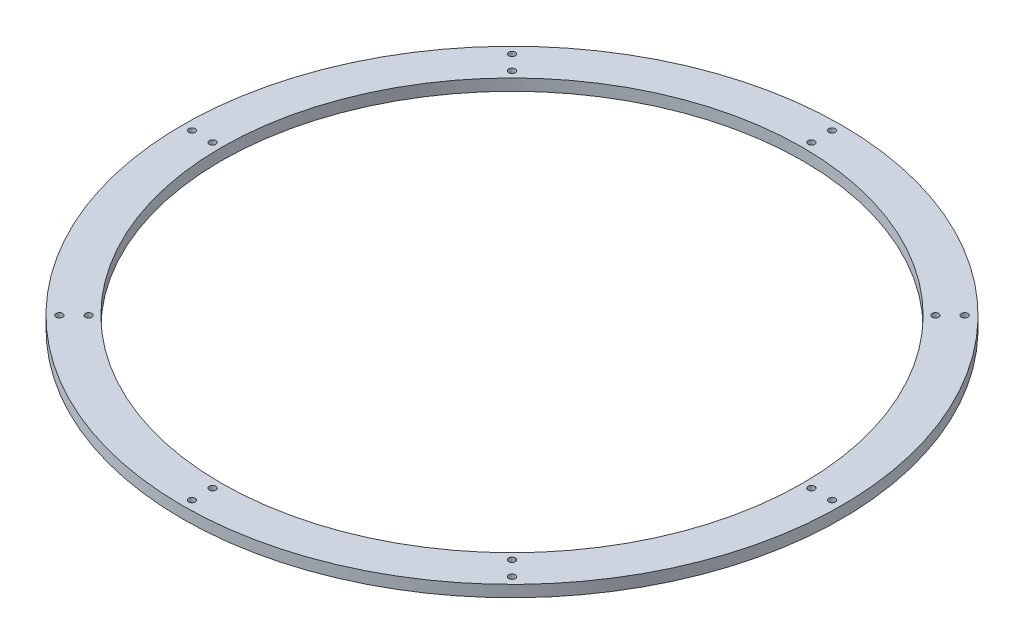
ISO-10303-21;
HEADER;
FILE_DESCRIPTION(('STEP AP214'),'2;1');
FILE_NAME('part.step','',(''),(''),'','','');
FILE_SCHEMA(('AUTOMOTIVE_DESIGN { 1 0 10303 214 1 1 1 1 }'));
ENDSEC;
DATA;
#1=APPLICATION_CONTEXT('core data for automotive mechanical design processes');
#2=APPLICATION_PROTOCOL_DEFINITION('international standard','automotive_design',2000,#1);
#3=PRODUCT_CONTEXT('',#1,'mechanical');
#4=PRODUCT('Part','Part','',(#3));
#5=PRODUCT_RELATED_PRODUCT_CATEGORY('part','',(#4));
#6=PRODUCT_DEFINITION_FORMATION('','',#4);
#7=PRODUCT_DEFINITION_CONTEXT('part definition',#1,'design');
#8=PRODUCT_DEFINITION('design','',#6,#7);
#9=PRODUCT_DEFINITION_SHAPE('','',#8);
#10=(LENGTH_UNIT() NAMED_UNIT(*) SI_UNIT(.MILLI.,.METRE.));
#11=(NAMED_UNIT(*) PLANE_ANGLE_UNIT() SI_UNIT($,.RADIAN.));
#12=(NAMED_UNIT(*) SI_UNIT($,.STERADIAN.) SOLID_ANGLE_UNIT());
#13=UNCERTAINTY_MEASURE_WITH_UNIT(LENGTH_MEASURE(1.E-05),#10,'distance_accuracy_value','');
#14=(GEOMETRIC_REPRESENTATION_CONTEXT(3) GLOBAL_UNCERTAINTY_ASSIGNED_CONTEXT((#13)) GLOBAL_UNIT_ASSIGNED_CONTEXT((#10,
#11,#12)) REPRESENTATION_CONTEXT('',''));
#15=CARTESIAN_POINT('',(0.,0.,0.));
#16=DIRECTION('',(0.,0.,1.));
#17=DIRECTION('',(1.,0.,0.));
#18=AXIS2_PLACEMENT_3D('',#15,#16,#17);
#19=CARTESIAN_POINT('',(0.,14.,0.));
#20=DIRECTION('',(0.,-1.,0.));
#21=DIRECTION('',(0.,0.,-1.));
#22=AXIS2_PLACEMENT_3D('',#19,#20,#21);
#23=CYLINDRICAL_SURFACE('',#22,399.);
#24=CARTESIAN_POINT('',(0.,14.,0.));
#25=DIRECTION('',(0.,1.,0.));
#26=DIRECTION('',(0.,0.,1.));
#27=AXIS2_PLACEMENT_3D('',#24,#25,#26);
#28=CIRCLE('',#27,399.);
#29=CARTESIAN_POINT('',(0.,14.,399.));
#30=VERTEX_POINT('',#29);
#31=EDGE_CURVE('E12',#30,#30,#28,.T.);
#32=ORIENTED_EDGE('',*,*,#31,.F.);
#33=EDGE_LOOP('',(#32));
#34=FACE_BOUND('',#33,.T.);
#35=CARTESIAN_POINT('',(0.,0.,0.));
#36=DIRECTION('',(0.,1.,0.));
#37=DIRECTION('',(0.,0.,1.));
#38=AXIS2_PLACEMENT_3D('',#35,#36,#37);
#39=CIRCLE('',#38,399.);
#40=CARTESIAN_POINT('',(0.,0.,399.));
#41=VERTEX_POINT('',#40);
#42=EDGE_CURVE('E49',#41,#41,#39,.T.);
#43=ORIENTED_EDGE('',*,*,#42,.T.);
#44=EDGE_LOOP('',(#43));
#45=FACE_BOUND('',#44,.T.);
#46=ADVANCED_FACE('F46',(#34,#45),#23,.T.);
#47=CARTESIAN_POINT('',(0.,14.,0.));
#48=DIRECTION('',(0.,1.,0.));
#49=DIRECTION('',(0.,0.,1.));
#50=AXIS2_PLACEMENT_3D('',#47,#48,#49);
#51=PLANE('',#50);
#52=CARTESIAN_POINT('',(-362.5,14.,1.26566198533064E-12));
#53=DIRECTION('',(0.,1.,0.));
#54=DIRECTION('',(1.,0.,0.));
#55=AXIS2_PLACEMENT_3D('',#52,#53,#54);
#56=CIRCLE('',#55,4.);
#57=CARTESIAN_POINT('',(-358.5,14.,1.25169605997526E-12));
#58=VERTEX_POINT('',#57);
#59=EDGE_CURVE('E143',#58,#58,#56,.T.);
#60=ORIENTED_EDGE('',*,*,#59,.F.);
#61=EDGE_LOOP('',(#60));
#62=FACE_BOUND('',#61,.T.);
#63=CARTESIAN_POINT('',(-256.326208180122,14.,256.326208180125));
#64=DIRECTION('',(0.,1.,0.));
#65=DIRECTION('',(0.707106781186544,0.,-0.707106781186551));
#66=AXIS2_PLACEMENT_3D('',#63,#64,#65);
#67=CIRCLE('',#66,4.);
#68=CARTESIAN_POINT('',(-253.497781055376,14.,253.497781055379));
#69=VERTEX_POINT('',#68);
#70=EDGE_CURVE('E137',#69,#69,#67,.T.);
#71=ORIENTED_EDGE('',*,*,#70,.F.);
#72=EDGE_LOOP('',(#71));
#73=FACE_BOUND('',#72,.T.);
#74=CARTESIAN_POINT('',(0.,14.,362.5));
#75=DIRECTION('',(0.,1.,0.));
#76=DIRECTION('',(0.,0.,-1.));
#77=AXIS2_PLACEMENT_3D('',#74,#75,#76);
#78=CIRCLE('',#77,4.);
#79=CARTESIAN_POINT('',(0.,14.,358.5));
#80=VERTEX_POINT('',#79);
#81=EDGE_CURVE('E131',#80,#80,#78,.T.);
#82=ORIENTED_EDGE('',*,*,#81,.F.);
#83=EDGE_LOOP('',(#82));
#84=FACE_BOUND('',#83,.T.);
#85=CARTESIAN_POINT('',(256.326208180126,14.,256.326208180121));
#86=DIRECTION('',(0.,1.,0.));
#87=DIRECTION('',(-0.707106781186554,0.,-0.707106781186541));
#88=AXIS2_PLACEMENT_3D('',#85,#86,#87);
#89=CIRCLE('',#88,4.);
#90=CARTESIAN_POINT('',(253.497781055379,14.,253.497781055375));
#91=VERTEX_POINT('',#90);
#92=EDGE_CURVE('E124',#91,#91,#89,.T.);
#93=ORIENTED_EDGE('',*,*,#92,.F.);
#94=EDGE_LOOP('',(#93));
#95=FACE_BOUND('',#94,.T.);
#96=CARTESIAN_POINT('',(362.5,14.,-3.79698595599191E-12));
#97=DIRECTION('',(0.,1.,0.));
#98=DIRECTION('',(-1.,0.,0.));
#99=AXIS2_PLACEMENT_3D('',#96,#97,#98);
#100=CIRCLE('',#99,4.);
#101=CARTESIAN_POINT('',(358.5,14.,-3.75508817992579E-12));
#102=VERTEX_POINT('',#101);
#103=EDGE_CURVE('E154',#102,#102,#100,.T.);
#104=ORIENTED_EDGE('',*,*,#103,.F.);
#105=EDGE_LOOP('',(#104));
#106=FACE_BOUND('',#105,.T.);
#107=CARTESIAN_POINT('',(256.32620818012,14.,-256.326208180127));
#108=DIRECTION('',(0.,1.,0.));
#109=DIRECTION('',(-0.707106781186539,0.,0.707106781186556));
#110=AXIS2_PLACEMENT_3D('',#107,#108,#109);
#111=CIRCLE('',#110,4.);
#112=CARTESIAN_POINT('',(253.497781055374,14.,-253.49778105538));
#113=VERTEX_POINT('',#112);
#114=EDGE_CURVE('E148',#113,#113,#111,.T.);
#115=ORIENTED_EDGE('',*,*,#114,.F.);
#116=EDGE_LOOP('',(#115));
#117=FACE_BOUND('',#116,.T.);
#118=CARTESIAN_POINT('',(-256.326208180124,14.,-256.326208180123));
#119=DIRECTION('',(0.,1.,0.));
#120=DIRECTION('',(0.707106781186549,0.,0.707106781186546));
#121=AXIS2_PLACEMENT_3D('',#118,#119,#120);
#122=CIRCLE('',#121,4.);
#123=CARTESIAN_POINT('',(-253.497781055378,14.,-253.497781055377));
#124=VERTEX_POINT('',#123);
#125=EDGE_CURVE('E118',#124,#124,#122,.T.);
#126=ORIENTED_EDGE('',*,*,#125,.F.);
#127=EDGE_LOOP('',(#126));
#128=FACE_BOUND('',#127,.T.);
#129=CARTESIAN_POINT('',(0.,14.,-362.5));
#130=DIRECTION('',(0.,1.,0.));
#131=DIRECTION('',(0.,0.,1.));
#132=AXIS2_PLACEMENT_3D('',#129,#130,#131);
#133=CIRCLE('',#132,4.);
#134=CARTESIAN_POINT('',(0.,14.,-358.5));
#135=VERTEX_POINT('',#134);
#136=EDGE_CURVE('E112',#135,#135,#133,.T.);
#137=ORIENTED_EDGE('',*,*,#136,.F.);
#138=EDGE_LOOP('',(#137));
#139=FACE_BOUND('',#138,.T.);
#140=CARTESIAN_POINT('',(387.499999999999,14.,1.35294901880171E-12));
#141=DIRECTION('',(0.,1.,0.));
#142=DIRECTION('',(0.,0.,1.));
#143=AXIS2_PLACEMENT_3D('',#140,#141,#142);
#144=CIRCLE('',#143,4.);
#145=CARTESIAN_POINT('',(387.499999999999,14.,4.00000000000135));
#146=VERTEX_POINT('',#145);
#147=EDGE_CURVE('E69',#146,#146,#144,.T.);
#148=ORIENTED_EDGE('',*,*,#147,.F.);
#149=EDGE_LOOP('',(#148));
#150=FACE_BOUND('',#149,.T.);
#151=CARTESIAN_POINT('',(274.003877709785,14.,274.003877709788));
#152=DIRECTION('',(0.,1.,0.));
#153=DIRECTION('',(0.,0.,1.));
#154=AXIS2_PLACEMENT_3D('',#151,#152,#153);
#155=CIRCLE('',#154,4.);
#156=CARTESIAN_POINT('',(274.003877709785,14.,278.003877709788));
#157=VERTEX_POINT('',#156);
#158=EDGE_CURVE('E72',#157,#157,#155,.T.);
#159=ORIENTED_EDGE('',*,*,#158,.F.);
#160=EDGE_LOOP('',(#159));
#161=FACE_BOUND('',#160,.T.);
#162=CARTESIAN_POINT('',(0.,14.,387.499999999999));
#163=DIRECTION('',(0.,1.,0.));
#164=DIRECTION('',(0.,0.,1.));
#165=AXIS2_PLACEMENT_3D('',#162,#163,#164);
#166=CIRCLE('',#165,4.);
#167=CARTESIAN_POINT('',(0.,14.,391.499999999999));
#168=VERTEX_POINT('',#167);
#169=EDGE_CURVE('E75',#168,#168,#166,.T.);
#170=ORIENTED_EDGE('',*,*,#169,.F.);
#171=EDGE_LOOP('',(#170));
#172=FACE_BOUND('',#171,.T.);
#173=CARTESIAN_POINT('',(-274.003877709789,14.,274.003877709784));
#174=DIRECTION('',(0.,1.,0.));
#175=DIRECTION('',(0.,0.,1.));
#176=AXIS2_PLACEMENT_3D('',#173,#174,#175);
#177=CIRCLE('',#176,4.);
#178=CARTESIAN_POINT('',(-274.003877709789,14.,278.003877709784));
#179=VERTEX_POINT('',#178);
#180=EDGE_CURVE('E78',#179,#179,#177,.T.);
#181=ORIENTED_EDGE('',*,*,#180,.F.);
#182=EDGE_LOOP('',(#181));
#183=FACE_BOUND('',#182,.T.);
#184=CARTESIAN_POINT('',(-387.499999999999,14.,-4.05884705640514E-12));
#185=DIRECTION('',(0.,1.,0.));
#186=DIRECTION('',(0.,0.,1.));
#187=AXIS2_PLACEMENT_3D('',#184,#185,#186);
#188=CIRCLE('',#187,4.);
#189=CARTESIAN_POINT('',(-387.499999999999,14.,3.99999999999594));
#190=VERTEX_POINT('',#189);
#191=EDGE_CURVE('E81',#190,#190,#188,.T.);
#192=ORIENTED_EDGE('',*,*,#191,.F.);
#193=EDGE_LOOP('',(#192));
#194=FACE_BOUND('',#193,.T.);
#195=CARTESIAN_POINT('',(-274.003877709783,14.,-274.00387770979));
#196=DIRECTION('',(0.,1.,0.));
#197=DIRECTION('',(0.,0.,1.));
#198=AXIS2_PLACEMENT_3D('',#195,#196,#197);
#199=CIRCLE('',#198,4.);
#200=CARTESIAN_POINT('',(-274.003877709783,14.,-270.00387770979));
#201=VERTEX_POINT('',#200);
#202=EDGE_CURVE('E84',#201,#201,#199,.T.);
#203=ORIENTED_EDGE('',*,*,#202,.F.);
#204=EDGE_LOOP('',(#203));
#205=FACE_BOUND('',#204,.T.);
#206=CARTESIAN_POINT('',(274.003877709787,14.,-274.003877709786));
#207=DIRECTION('',(0.,1.,0.));
#208=DIRECTION('',(0.,0.,1.));
#209=AXIS2_PLACEMENT_3D('',#206,#207,#208);
#210=CIRCLE('',#209,4.);
#211=CARTESIAN_POINT('',(274.003877709787,14.,-270.003877709786));
#212=VERTEX_POINT('',#211);
#213=EDGE_CURVE('E87',#212,#212,#210,.T.);
#214=ORIENTED_EDGE('',*,*,#213,.F.);
#215=EDGE_LOOP('',(#214));
#216=FACE_BOUND('',#215,.T.);
#217=CARTESIAN_POINT('',(0.,14.,-387.499999999999));
#218=DIRECTION('',(0.,1.,0.));
#219=DIRECTION('',(0.,0.,1.));
#220=AXIS2_PLACEMENT_3D('',#217,#218,#219);
#221=CIRCLE('',#220,4.);
#222=CARTESIAN_POINT('',(0.,14.,-383.499999999999));
#223=VERTEX_POINT('',#222);
#224=EDGE_CURVE('E61',#223,#223,#221,.T.);
#225=ORIENTED_EDGE('',*,*,#224,.F.);
#226=EDGE_LOOP('',(#225));
#227=FACE_BOUND('',#226,.T.);
#228=CARTESIAN_POINT('',(0.,14.,0.));
#229=DIRECTION('',(0.,1.,0.));
#230=DIRECTION('',(0.,0.,1.));
#231=AXIS2_PLACEMENT_3D('',#228,#229,#230);
#232=CIRCLE('',#231,352.);
#233=CARTESIAN_POINT('',(0.,14.,352.));
#234=VERTEX_POINT('',#233);
#235=EDGE_CURVE('E58',#234,#234,#232,.T.);
#236=ORIENTED_EDGE('',*,*,#235,.F.);
#237=EDGE_LOOP('',(#236));
#238=FACE_BOUND('',#237,.T.);
#239=ORIENTED_EDGE('',*,*,#31,.T.);
#240=EDGE_LOOP('',(#239));
#241=FACE_BOUND('',#240,.T.);
#242=ADVANCED_FACE('F171',(#62,#73,#84,#95,#106,#117,#128,#139,#150,#161,#172,#183,#194,#205,
#216,#227,#238,#241),#51,.T.);
#243=CARTESIAN_POINT('',(0.,0.,0.));
#244=DIRECTION('',(0.,1.,0.));
#245=DIRECTION('',(0.,0.,1.));
#246=AXIS2_PLACEMENT_3D('',#243,#244,#245);
#247=PLANE('',#246);
#248=CARTESIAN_POINT('',(-362.5,0.,1.26566198533064E-12));
#249=DIRECTION('',(0.,1.,0.));
#250=DIRECTION('',(1.,0.,0.));
#251=AXIS2_PLACEMENT_3D('',#248,#249,#250);
#252=CIRCLE('',#251,4.);
#253=CARTESIAN_POINT('',(-358.5,0.,1.25169605997526E-12));
#254=VERTEX_POINT('',#253);
#255=EDGE_CURVE('E121',#254,#254,#252,.T.);
#256=ORIENTED_EDGE('',*,*,#255,.T.);
#257=EDGE_LOOP('',(#256));
#258=FACE_BOUND('',#257,.T.);
#259=CARTESIAN_POINT('',(-256.326208180122,0.,256.326208180125));
#260=DIRECTION('',(0.,1.,0.));
#261=DIRECTION('',(0.707106781186544,0.,-0.707106781186551));
#262=AXIS2_PLACEMENT_3D('',#259,#260,#261);
#263=CIRCLE('',#262,4.);
#264=CARTESIAN_POINT('',(-253.497781055376,0.,253.497781055379));
#265=VERTEX_POINT('',#264);
#266=EDGE_CURVE('E140',#265,#265,#263,.T.);
#267=ORIENTED_EDGE('',*,*,#266,.T.);
#268=EDGE_LOOP('',(#267));
#269=FACE_BOUND('',#268,.T.);
#270=CARTESIAN_POINT('',(0.,0.,362.5));
#271=DIRECTION('',(0.,1.,0.));
#272=DIRECTION('',(0.,0.,-1.));
#273=AXIS2_PLACEMENT_3D('',#270,#271,#272);
#274=CIRCLE('',#273,4.);
#275=CARTESIAN_POINT('',(0.,0.,358.5));
#276=VERTEX_POINT('',#275);
#277=EDGE_CURVE('E134',#276,#276,#274,.T.);
#278=ORIENTED_EDGE('',*,*,#277,.T.);
#279=EDGE_LOOP('',(#278));
#280=FACE_BOUND('',#279,.T.);
#281=CARTESIAN_POINT('',(256.326208180126,0.,256.326208180121));
#282=DIRECTION('',(0.,1.,0.));
#283=DIRECTION('',(-0.707106781186554,0.,-0.707106781186541));
#284=AXIS2_PLACEMENT_3D('',#281,#282,#283);
#285=CIRCLE('',#284,4.);
#286=CARTESIAN_POINT('',(253.497781055379,0.,253.497781055375));
#287=VERTEX_POINT('',#286);
#288=EDGE_CURVE('E127',#287,#287,#285,.T.);
#289=ORIENTED_EDGE('',*,*,#288,.T.);
#290=EDGE_LOOP('',(#289));
#291=FACE_BOUND('',#290,.T.);
#292=CARTESIAN_POINT('',(362.5,0.,-3.79698595599191E-12));
#293=DIRECTION('',(0.,1.,0.));
#294=DIRECTION('',(-1.,0.,0.));
#295=AXIS2_PLACEMENT_3D('',#292,#293,#294);
#296=CIRCLE('',#295,4.);
#297=CARTESIAN_POINT('',(358.5,0.,-3.75508817992579E-12));
#298=VERTEX_POINT('',#297);
#299=EDGE_CURVE('E128',#298,#298,#296,.T.);
#300=ORIENTED_EDGE('',*,*,#299,.T.);
#301=EDGE_LOOP('',(#300));
#302=FACE_BOUND('',#301,.T.);
#303=CARTESIAN_POINT('',(256.32620818012,0.,-256.326208180127));
#304=DIRECTION('',(0.,1.,0.));
#305=DIRECTION('',(-0.707106781186539,0.,0.707106781186556));
#306=AXIS2_PLACEMENT_3D('',#303,#304,#305);
#307=CIRCLE('',#306,4.);
#308=CARTESIAN_POINT('',(253.497781055374,0.,-253.49778105538));
#309=VERTEX_POINT('',#308);
#310=EDGE_CURVE('E151',#309,#309,#307,.T.);
#311=ORIENTED_EDGE('',*,*,#310,.T.);
#312=EDGE_LOOP('',(#311));
#313=FACE_BOUND('',#312,.T.);
#314=CARTESIAN_POINT('',(-256.326208180124,0.,-256.326208180123));
#315=DIRECTION('',(0.,1.,0.));
#316=DIRECTION('',(0.707106781186549,0.,0.707106781186546));
#317=AXIS2_PLACEMENT_3D('',#314,#315,#316);
#318=CIRCLE('',#317,4.);
#319=CARTESIAN_POINT('',(-253.497781055378,0.,-253.497781055377));
#320=VERTEX_POINT('',#319);
#321=EDGE_CURVE('E115',#320,#320,#318,.T.);
#322=ORIENTED_EDGE('',*,*,#321,.T.);
#323=EDGE_LOOP('',(#322));
#324=FACE_BOUND('',#323,.T.);
#325=CARTESIAN_POINT('',(0.,0.,-362.5));
#326=DIRECTION('',(0.,1.,0.));
#327=DIRECTION('',(0.,0.,1.));
#328=AXIS2_PLACEMENT_3D('',#325,#326,#327);
#329=CIRCLE('',#328,4.);
#330=CARTESIAN_POINT('',(0.,0.,-358.5));
#331=VERTEX_POINT('',#330);
#332=EDGE_CURVE('E109',#331,#331,#329,.T.);
#333=ORIENTED_EDGE('',*,*,#332,.T.);
#334=EDGE_LOOP('',(#333));
#335=FACE_BOUND('',#334,.T.);
#336=CARTESIAN_POINT('',(387.499999999999,0.,1.35294901880171E-12));
#337=DIRECTION('',(0.,-1.,0.));
#338=DIRECTION('',(1.,0.,0.));
#339=AXIS2_PLACEMENT_3D('',#336,#337,#338);
#340=CIRCLE('',#339,4.);
#341=CARTESIAN_POINT('',(391.499999999999,0.,1.36691494415708E-12));
#342=VERTEX_POINT('',#341);
#343=EDGE_CURVE('E93',#342,#342,#340,.T.);
#344=ORIENTED_EDGE('',*,*,#343,.F.);
#345=EDGE_LOOP('',(#344));
#346=FACE_BOUND('',#345,.T.);
#347=CARTESIAN_POINT('',(274.003877709785,0.,274.003877709788));
#348=DIRECTION('',(0.,-1.,0.));
#349=DIRECTION('',(0.707106781186544,0.,0.707106781186551));
#350=AXIS2_PLACEMENT_3D('',#347,#348,#349);
#351=CIRCLE('',#350,4.);
#352=CARTESIAN_POINT('',(276.832304834531,0.,276.832304834534));
#353=VERTEX_POINT('',#352);
#354=EDGE_CURVE('E101',#353,#353,#351,.T.);
#355=ORIENTED_EDGE('',*,*,#354,.F.);
#356=EDGE_LOOP('',(#355));
#357=FACE_BOUND('',#356,.T.);
#358=CARTESIAN_POINT('',(0.,0.,387.499999999999));
#359=DIRECTION('',(0.,-1.,0.));
#360=DIRECTION('',(0.,0.,1.));
#361=AXIS2_PLACEMENT_3D('',#358,#359,#360);
#362=CIRCLE('',#361,4.);
#363=CARTESIAN_POINT('',(0.,0.,391.499999999999));
#364=VERTEX_POINT('',#363);
#365=EDGE_CURVE('E97',#364,#364,#362,.T.);
#366=ORIENTED_EDGE('',*,*,#365,.F.);
#367=EDGE_LOOP('',(#366));
#368=FACE_BOUND('',#367,.T.);
#369=CARTESIAN_POINT('',(-274.003877709789,0.,274.003877709784));
#370=DIRECTION('',(0.,-1.,0.));
#371=DIRECTION('',(-0.707106781186554,0.,0.707106781186541));
#372=AXIS2_PLACEMENT_3D('',#369,#370,#371);
#373=CIRCLE('',#372,4.);
#374=CARTESIAN_POINT('',(-276.832304834535,0.,276.83230483453));
#375=VERTEX_POINT('',#374);
#376=EDGE_CURVE('E94',#375,#375,#373,.T.);
#377=ORIENTED_EDGE('',*,*,#376,.F.);
#378=EDGE_LOOP('',(#377));
#379=FACE_BOUND('',#378,.T.);
#380=CARTESIAN_POINT('',(-387.499999999999,0.,-4.05884705640514E-12));
#381=DIRECTION('',(0.,-1.,0.));
#382=DIRECTION('',(-1.,0.,0.));
#383=AXIS2_PLACEMENT_3D('',#380,#381,#382);
#384=CIRCLE('',#383,4.);
#385=CARTESIAN_POINT('',(-391.499999999999,0.,-4.10074483247125E-12));
#386=VERTEX_POINT('',#385);
#387=EDGE_CURVE('E98',#386,#386,#384,.T.);
#388=ORIENTED_EDGE('',*,*,#387,.F.);
#389=EDGE_LOOP('',(#388));
#390=FACE_BOUND('',#389,.T.);
#391=CARTESIAN_POINT('',(-274.003877709783,0.,-274.00387770979));
#392=DIRECTION('',(0.,-1.,0.));
#393=DIRECTION('',(-0.707106781186539,0.,-0.707106781186556));
#394=AXIS2_PLACEMENT_3D('',#391,#392,#393);
#395=CIRCLE('',#394,4.);
#396=CARTESIAN_POINT('',(-276.83230483453,0.,-276.832304834536));
#397=VERTEX_POINT('',#396);
#398=EDGE_CURVE('E106',#397,#397,#395,.T.);
#399=ORIENTED_EDGE('',*,*,#398,.F.);
#400=EDGE_LOOP('',(#399));
#401=FACE_BOUND('',#400,.T.);
#402=CARTESIAN_POINT('',(274.003877709787,0.,-274.003877709786));
#403=DIRECTION('',(0.,-1.,0.));
#404=DIRECTION('',(0.707106781186549,0.,-0.707106781186546));
#405=AXIS2_PLACEMENT_3D('',#402,#403,#404);
#406=CIRCLE('',#405,4.);
#407=CARTESIAN_POINT('',(276.832304834533,0.,-276.832304834532));
#408=VERTEX_POINT('',#407);
#409=EDGE_CURVE('E90',#408,#408,#406,.T.);
#410=ORIENTED_EDGE('',*,*,#409,.F.);
#411=EDGE_LOOP('',(#410));
#412=FACE_BOUND('',#411,.T.);
#413=CARTESIAN_POINT('',(0.,0.,-387.499999999999));
#414=DIRECTION('',(0.,-1.,0.));
#415=DIRECTION('',(0.,0.,-1.));
#416=AXIS2_PLACEMENT_3D('',#413,#414,#415);
#417=CIRCLE('',#416,4.);
#418=CARTESIAN_POINT('',(0.,0.,-391.499999999999));
#419=VERTEX_POINT('',#418);
#420=EDGE_CURVE('E66',#419,#419,#417,.T.);
#421=ORIENTED_EDGE('',*,*,#420,.F.);
#422=EDGE_LOOP('',(#421));
#423=FACE_BOUND('',#422,.T.);
#424=CARTESIAN_POINT('',(0.,0.,0.));
#425=DIRECTION('',(0.,1.,0.));
#426=DIRECTION('',(0.,0.,1.));
#427=AXIS2_PLACEMENT_3D('',#424,#425,#426);
#428=CIRCLE('',#427,352.);
#429=CARTESIAN_POINT('',(0.,0.,352.));
#430=VERTEX_POINT('',#429);
#431=EDGE_CURVE('E56',#430,#430,#428,.T.);
#432=ORIENTED_EDGE('',*,*,#431,.T.);
#433=EDGE_LOOP('',(#432));
#434=FACE_BOUND('',#433,.T.);
#435=ORIENTED_EDGE('',*,*,#42,.F.);
#436=EDGE_LOOP('',(#435));
#437=FACE_BOUND('',#436,.T.);
#438=ADVANCED_FACE('F160',(#258,#269,#280,#291,#302,#313,#324,#335,#346,#357,#368,#379,#390,
#401,#412,#423,#434,#437),#247,.F.);
#439=CARTESIAN_POINT('',(0.,0.,0.));
#440=DIRECTION('',(0.,1.,0.));
#441=DIRECTION('',(0.,0.,1.));
#442=AXIS2_PLACEMENT_3D('',#439,#440,#441);
#443=CYLINDRICAL_SURFACE('',#442,352.);
#444=ORIENTED_EDGE('',*,*,#431,.F.);
#445=EDGE_LOOP('',(#444));
#446=FACE_BOUND('',#445,.T.);
#447=ORIENTED_EDGE('',*,*,#235,.T.);
#448=EDGE_LOOP('',(#447));
#449=FACE_BOUND('',#448,.T.);
#450=ADVANCED_FACE('F200',(#446,#449),#443,.F.);
#451=CARTESIAN_POINT('',(0.,19.304,-387.499999999999));
#452=DIRECTION('',(0.,-1.,0.));
#453=DIRECTION('',(0.,0.,-1.));
#454=AXIS2_PLACEMENT_3D('',#451,#452,#453);
#455=CYLINDRICAL_SURFACE('',#454,4.);
#456=ORIENTED_EDGE('',*,*,#224,.T.);
#457=EDGE_LOOP('',(#456));
#458=FACE_BOUND('',#457,.T.);
#459=ORIENTED_EDGE('',*,*,#420,.T.);
#460=EDGE_LOOP('',(#459));
#461=FACE_BOUND('',#460,.T.);
#462=ADVANCED_FACE('F202',(#458,#461),#455,.F.);
#463=CARTESIAN_POINT('',(274.003877709787,19.304,-274.003877709786));
#464=DIRECTION('',(0.,-1.,0.));
#465=DIRECTION('',(0.,0.,-1.));
#466=AXIS2_PLACEMENT_3D('',#463,#464,#465);
#467=CYLINDRICAL_SURFACE('',#466,4.);
#468=ORIENTED_EDGE('',*,*,#213,.T.);
#469=EDGE_LOOP('',(#468));
#470=FACE_BOUND('',#469,.T.);
#471=ORIENTED_EDGE('',*,*,#409,.T.);
#472=EDGE_LOOP('',(#471));
#473=FACE_BOUND('',#472,.T.);
#474=ADVANCED_FACE('F209',(#470,#473),#467,.F.);
#475=CARTESIAN_POINT('',(-274.003877709783,19.304,-274.00387770979));
#476=DIRECTION('',(0.,-1.,0.));
#477=DIRECTION('',(0.,0.,-1.));
#478=AXIS2_PLACEMENT_3D('',#475,#476,#477);
#479=CYLINDRICAL_SURFACE('',#478,4.);
#480=ORIENTED_EDGE('',*,*,#202,.T.);
#481=EDGE_LOOP('',(#480));
#482=FACE_BOUND('',#481,.T.);
#483=ORIENTED_EDGE('',*,*,#398,.T.);
#484=EDGE_LOOP('',(#483));
#485=FACE_BOUND('',#484,.T.);
#486=ADVANCED_FACE('F312',(#482,#485),#479,.F.);
#487=CARTESIAN_POINT('',(-387.499999999999,19.304,-4.05884705640514E-12));
#488=DIRECTION('',(0.,-1.,0.));
#489=DIRECTION('',(0.,0.,-1.));
#490=AXIS2_PLACEMENT_3D('',#487,#488,#489);
#491=CYLINDRICAL_SURFACE('',#490,4.);
#492=ORIENTED_EDGE('',*,*,#191,.T.);
#493=EDGE_LOOP('',(#492));
#494=FACE_BOUND('',#493,.T.);
#495=ORIENTED_EDGE('',*,*,#387,.T.);
#496=EDGE_LOOP('',(#495));
#497=FACE_BOUND('',#496,.T.);
#498=ADVANCED_FACE('F308',(#494,#497),#491,.F.);
#499=CARTESIAN_POINT('',(-274.003877709789,19.304,274.003877709784));
#500=DIRECTION('',(0.,-1.,0.));
#501=DIRECTION('',(0.,0.,-1.));
#502=AXIS2_PLACEMENT_3D('',#499,#500,#501);
#503=CYLINDRICAL_SURFACE('',#502,4.);
#504=ORIENTED_EDGE('',*,*,#180,.T.);
#505=EDGE_LOOP('',(#504));
#506=FACE_BOUND('',#505,.T.);
#507=ORIENTED_EDGE('',*,*,#376,.T.);
#508=EDGE_LOOP('',(#507));
#509=FACE_BOUND('',#508,.T.);
#510=ADVANCED_FACE('F311',(#506,#509),#503,.F.);
#511=CARTESIAN_POINT('',(0.,19.304,387.499999999999));
#512=DIRECTION('',(0.,-1.,0.));
#513=DIRECTION('',(0.,0.,-1.));
#514=AXIS2_PLACEMENT_3D('',#511,#512,#513);
#515=CYLINDRICAL_SURFACE('',#514,4.);
#516=ORIENTED_EDGE('',*,*,#169,.T.);
#517=EDGE_LOOP('',(#516));
#518=FACE_BOUND('',#517,.T.);
#519=ORIENTED_EDGE('',*,*,#365,.T.);
#520=EDGE_LOOP('',(#519));
#521=FACE_BOUND('',#520,.T.);
#522=ADVANCED_FACE('F323',(#518,#521),#515,.F.);
#523=CARTESIAN_POINT('',(274.003877709785,19.304,274.003877709788));
#524=DIRECTION('',(0.,-1.,0.));
#525=DIRECTION('',(0.,0.,-1.));
#526=AXIS2_PLACEMENT_3D('',#523,#524,#525);
#527=CYLINDRICAL_SURFACE('',#526,4.);
#528=ORIENTED_EDGE('',*,*,#158,.T.);
#529=EDGE_LOOP('',(#528));
#530=FACE_BOUND('',#529,.T.);
#531=ORIENTED_EDGE('',*,*,#354,.T.);
#532=EDGE_LOOP('',(#531));
#533=FACE_BOUND('',#532,.T.);
#534=ADVANCED_FACE('F319',(#530,#533),#527,.F.);
#535=CARTESIAN_POINT('',(387.499999999999,19.304,1.35294901880171E-12));
#536=DIRECTION('',(0.,-1.,0.));
#537=DIRECTION('',(0.,0.,-1.));
#538=AXIS2_PLACEMENT_3D('',#535,#536,#537);
#539=CYLINDRICAL_SURFACE('',#538,4.);
#540=ORIENTED_EDGE('',*,*,#147,.T.);
#541=EDGE_LOOP('',(#540));
#542=FACE_BOUND('',#541,.T.);
#543=ORIENTED_EDGE('',*,*,#343,.T.);
#544=EDGE_LOOP('',(#543));
#545=FACE_BOUND('',#544,.T.);
#546=ADVANCED_FACE('F306',(#542,#545),#539,.F.);
#547=CARTESIAN_POINT('',(0.,0.,-362.5));
#548=DIRECTION('',(0.,1.,0.));
#549=DIRECTION('',(0.,0.,1.));
#550=AXIS2_PLACEMENT_3D('',#547,#548,#549);
#551=CYLINDRICAL_SURFACE('',#550,4.);
#552=ORIENTED_EDGE('',*,*,#332,.F.);
#553=EDGE_LOOP('',(#552));
#554=FACE_BOUND('',#553,.T.);
#555=ORIENTED_EDGE('',*,*,#136,.T.);
#556=EDGE_LOOP('',(#555));
#557=FACE_BOUND('',#556,.T.);
#558=ADVANCED_FACE('F241',(#554,#557),#551,.F.);
#559=CARTESIAN_POINT('',(-256.326208180124,0.,-256.326208180123));
#560=DIRECTION('',(0.,1.,0.));
#561=DIRECTION('',(0.,0.,1.));
#562=AXIS2_PLACEMENT_3D('',#559,#560,#561);
#563=CYLINDRICAL_SURFACE('',#562,4.);
#564=ORIENTED_EDGE('',*,*,#321,.F.);
#565=EDGE_LOOP('',(#564));
#566=FACE_BOUND('',#565,.T.);
#567=ORIENTED_EDGE('',*,*,#125,.T.);
#568=EDGE_LOOP('',(#567));
#569=FACE_BOUND('',#568,.T.);
#570=ADVANCED_FACE('F236',(#566,#569),#563,.F.);
#571=CARTESIAN_POINT('',(256.32620818012,0.,-256.326208180127));
#572=DIRECTION('',(0.,1.,0.));
#573=DIRECTION('',(0.,0.,1.));
#574=AXIS2_PLACEMENT_3D('',#571,#572,#573);
#575=CYLINDRICAL_SURFACE('',#574,4.);
#576=ORIENTED_EDGE('',*,*,#310,.F.);
#577=EDGE_LOOP('',(#576));
#578=FACE_BOUND('',#577,.T.);
#579=ORIENTED_EDGE('',*,*,#114,.T.);
#580=EDGE_LOOP('',(#579));
#581=FACE_BOUND('',#580,.T.);
#582=ADVANCED_FACE('F167',(#578,#581),#575,.F.);
#583=CARTESIAN_POINT('',(362.5,0.,-3.79698595599191E-12));
#584=DIRECTION('',(0.,1.,0.));
#585=DIRECTION('',(0.,0.,1.));
#586=AXIS2_PLACEMENT_3D('',#583,#584,#585);
#587=CYLINDRICAL_SURFACE('',#586,4.);
#588=ORIENTED_EDGE('',*,*,#299,.F.);
#589=EDGE_LOOP('',(#588));
#590=FACE_BOUND('',#589,.T.);
#591=ORIENTED_EDGE('',*,*,#103,.T.);
#592=EDGE_LOOP('',(#591));
#593=FACE_BOUND('',#592,.T.);
#594=ADVANCED_FACE('F163',(#590,#593),#587,.F.);
#595=CARTESIAN_POINT('',(256.326208180126,0.,256.326208180121));
#596=DIRECTION('',(0.,1.,0.));
#597=DIRECTION('',(0.,0.,1.));
#598=AXIS2_PLACEMENT_3D('',#595,#596,#597);
#599=CYLINDRICAL_SURFACE('',#598,4.);
#600=ORIENTED_EDGE('',*,*,#288,.F.);
#601=EDGE_LOOP('',(#600));
#602=FACE_BOUND('',#601,.T.);
#603=ORIENTED_EDGE('',*,*,#92,.T.);
#604=EDGE_LOOP('',(#603));
#605=FACE_BOUND('',#604,.T.);
#606=ADVANCED_FACE('F166',(#602,#605),#599,.F.);
#607=CARTESIAN_POINT('',(0.,0.,362.5));
#608=DIRECTION('',(0.,1.,0.));
#609=DIRECTION('',(0.,0.,1.));
#610=AXIS2_PLACEMENT_3D('',#607,#608,#609);
#611=CYLINDRICAL_SURFACE('',#610,4.);
#612=ORIENTED_EDGE('',*,*,#277,.F.);
#613=EDGE_LOOP('',(#612));
#614=FACE_BOUND('',#613,.T.);
#615=ORIENTED_EDGE('',*,*,#81,.T.);
#616=EDGE_LOOP('',(#615));
#617=FACE_BOUND('',#616,.T.);
#618=ADVANCED_FACE('F268',(#614,#617),#611,.F.);
#619=CARTESIAN_POINT('',(-256.326208180122,0.,256.326208180125));
#620=DIRECTION('',(0.,1.,0.));
#621=DIRECTION('',(0.,0.,1.));
#622=AXIS2_PLACEMENT_3D('',#619,#620,#621);
#623=CYLINDRICAL_SURFACE('',#622,4.);
#624=ORIENTED_EDGE('',*,*,#266,.F.);
#625=EDGE_LOOP('',(#624));
#626=FACE_BOUND('',#625,.T.);
#627=ORIENTED_EDGE('',*,*,#70,.T.);
#628=EDGE_LOOP('',(#627));
#629=FACE_BOUND('',#628,.T.);
#630=ADVANCED_FACE('F278',(#626,#629),#623,.F.);
#631=CARTESIAN_POINT('',(-362.5,0.,1.26566198533064E-12));
#632=DIRECTION('',(0.,1.,0.));
#633=DIRECTION('',(0.,0.,1.));
#634=AXIS2_PLACEMENT_3D('',#631,#632,#633);
#635=CYLINDRICAL_SURFACE('',#634,4.);
#636=ORIENTED_EDGE('',*,*,#255,.F.);
#637=EDGE_LOOP('',(#636));
#638=FACE_BOUND('',#637,.T.);
#639=ORIENTED_EDGE('',*,*,#59,.T.);
#640=EDGE_LOOP('',(#639));
#641=FACE_BOUND('',#640,.T.);
#642=ADVANCED_FACE('F288',(#638,#641),#635,.F.);
#643=CLOSED_SHELL('',(#46,#242,#438,#450,#462,#474,#486,#498,#510,#522,#534,#546,#558,#570,#582,
#594,#606,#618,#630,#642));
#644=MANIFOLD_SOLID_BREP('B2',#643);
#645=ADVANCED_BREP_SHAPE_REPRESENTATION('',(#18,#644),#14);
#646=SHAPE_DEFINITION_REPRESENTATION(#9,#645);
ENDSEC;
END-ISO-10303-21;
